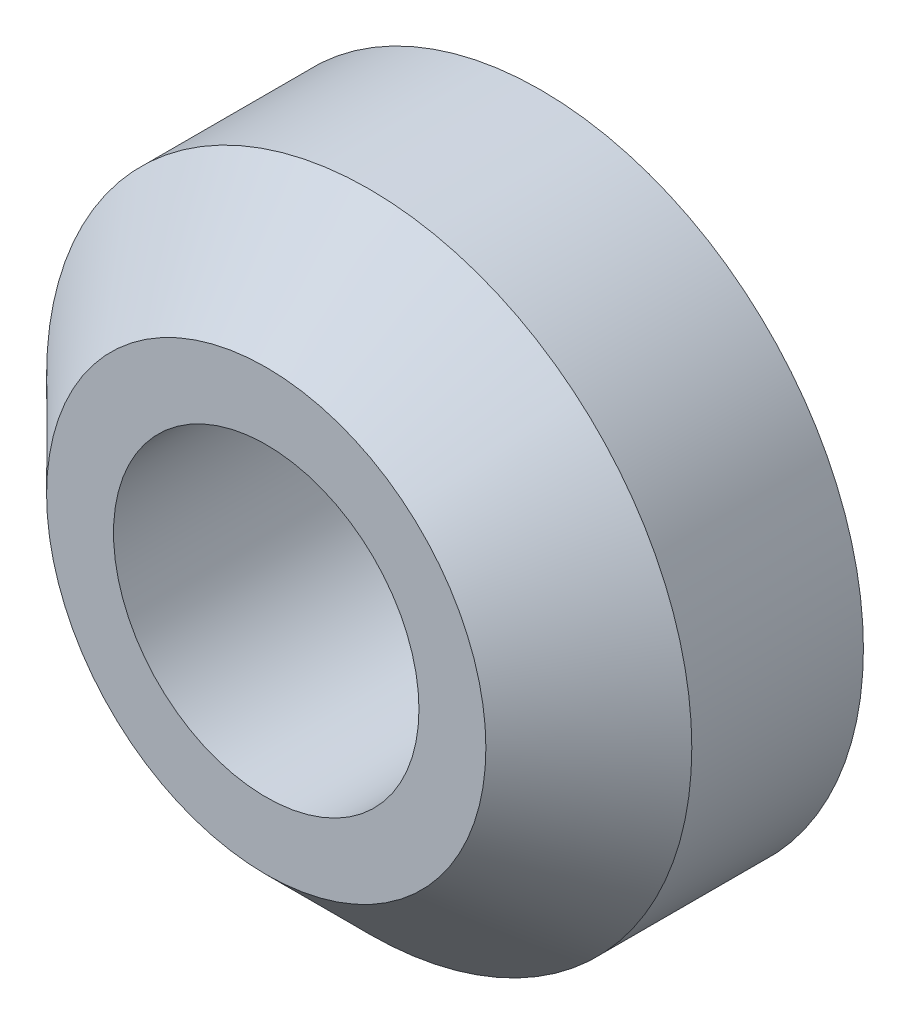
ISO-10303-21;
HEADER;
FILE_DESCRIPTION(('STEP AP214'),'2;1');
FILE_NAME('part.step','',(''),(''),'','','');
FILE_SCHEMA(('AUTOMOTIVE_DESIGN { 1 0 10303 214 1 1 1 1 }'));
ENDSEC;
DATA;
#1=APPLICATION_CONTEXT('core data for automotive mechanical design processes');
#2=APPLICATION_PROTOCOL_DEFINITION('international standard','automotive_design',2000,#1);
#3=PRODUCT_CONTEXT('',#1,'mechanical');
#4=PRODUCT('Part','Part','',(#3));
#5=PRODUCT_RELATED_PRODUCT_CATEGORY('part','',(#4));
#6=PRODUCT_DEFINITION_FORMATION('','',#4);
#7=PRODUCT_DEFINITION_CONTEXT('part definition',#1,'design');
#8=PRODUCT_DEFINITION('design','',#6,#7);
#9=PRODUCT_DEFINITION_SHAPE('','',#8);
#10=(LENGTH_UNIT() NAMED_UNIT(*) SI_UNIT(.MILLI.,.METRE.));
#11=(NAMED_UNIT(*) PLANE_ANGLE_UNIT() SI_UNIT($,.RADIAN.));
#12=(NAMED_UNIT(*) SI_UNIT($,.STERADIAN.) SOLID_ANGLE_UNIT());
#13=UNCERTAINTY_MEASURE_WITH_UNIT(LENGTH_MEASURE(1.E-05),#10,'distance_accuracy_value','');
#14=(GEOMETRIC_REPRESENTATION_CONTEXT(3) GLOBAL_UNCERTAINTY_ASSIGNED_CONTEXT((#13)) GLOBAL_UNIT_ASSIGNED_CONTEXT((#10,
#11,#12)) REPRESENTATION_CONTEXT('',''));
#15=CARTESIAN_POINT('',(0.,0.,0.));
#16=DIRECTION('',(0.,0.,1.));
#17=DIRECTION('',(1.,0.,0.));
#18=AXIS2_PLACEMENT_3D('',#15,#16,#17);
#19=CARTESIAN_POINT('',(0.,0.,2.032));
#20=DIRECTION('',(0.,0.,1.));
#21=DIRECTION('',(1.,0.,0.));
#22=AXIS2_PLACEMENT_3D('',#19,#20,#21);
#23=PLANE('',#22);
#24=CARTESIAN_POINT('',(0.,0.,2.032));
#25=DIRECTION('',(0.,0.,1.));
#26=DIRECTION('',(1.,0.,0.));
#27=AXIS2_PLACEMENT_3D('',#24,#25,#26);
#28=CIRCLE('',#27,1.6256);
#29=CARTESIAN_POINT('',(1.6256,0.,2.032));
#30=VERTEX_POINT('',#29);
#31=EDGE_CURVE('E42',#30,#30,#28,.T.);
#32=ORIENTED_EDGE('',*,*,#31,.T.);
#33=EDGE_LOOP('',(#32));
#34=FACE_BOUND('',#33,.T.);
#35=CARTESIAN_POINT('',(0.,0.,2.032));
#36=DIRECTION('',(0.,0.,1.));
#37=DIRECTION('',(1.,0.,0.));
#38=AXIS2_PLACEMENT_3D('',#35,#36,#37);
#39=CIRCLE('',#38,1.1303);
#40=CARTESIAN_POINT('',(1.1303,0.,2.032));
#41=VERTEX_POINT('',#40);
#42=EDGE_CURVE('E53',#41,#41,#39,.T.);
#43=ORIENTED_EDGE('',*,*,#42,.F.);
#44=EDGE_LOOP('',(#43));
#45=FACE_BOUND('',#44,.T.);
#46=ADVANCED_FACE('F34',(#34,#45),#23,.T.);
#47=CARTESIAN_POINT('',(0.,0.,0.));
#48=DIRECTION('',(0.,0.,1.));
#49=DIRECTION('',(1.,0.,0.));
#50=AXIS2_PLACEMENT_3D('',#47,#48,#49);
#51=PLANE('',#50);
#52=CARTESIAN_POINT('',(0.,0.,0.));
#53=DIRECTION('',(0.,0.,1.));
#54=DIRECTION('',(1.,0.,0.));
#55=AXIS2_PLACEMENT_3D('',#52,#53,#54);
#56=CIRCLE('',#55,2.3876);
#57=CARTESIAN_POINT('',(2.3876,0.,0.));
#58=VERTEX_POINT('',#57);
#59=EDGE_CURVE('E47',#58,#58,#56,.T.);
#60=ORIENTED_EDGE('',*,*,#59,.F.);
#61=EDGE_LOOP('',(#60));
#62=FACE_BOUND('',#61,.T.);
#63=CARTESIAN_POINT('',(0.,0.,0.));
#64=DIRECTION('',(0.,0.,1.));
#65=DIRECTION('',(1.,0.,0.));
#66=AXIS2_PLACEMENT_3D('',#63,#64,#65);
#67=CIRCLE('',#66,1.1303);
#68=CARTESIAN_POINT('',(1.1303,0.,0.));
#69=VERTEX_POINT('',#68);
#70=EDGE_CURVE('E56',#69,#69,#67,.T.);
#71=ORIENTED_EDGE('',*,*,#70,.T.);
#72=EDGE_LOOP('',(#71));
#73=FACE_BOUND('',#72,.T.);
#74=ADVANCED_FACE('F67',(#62,#73),#51,.F.);
#75=CARTESIAN_POINT('',(0.,0.,2.032));
#76=DIRECTION('',(0.,0.,-1.));
#77=DIRECTION('',(-1.,0.,0.));
#78=AXIS2_PLACEMENT_3D('',#75,#76,#77);
#79=CYLINDRICAL_SURFACE('',#78,2.3876);
#80=CARTESIAN_POINT('',(0.,0.,1.27));
#81=DIRECTION('',(0.,0.,1.));
#82=DIRECTION('',(1.,0.,0.));
#83=AXIS2_PLACEMENT_3D('',#80,#81,#82);
#84=CIRCLE('',#83,2.3876);
#85=CARTESIAN_POINT('',(2.3876,0.,1.27));
#86=VERTEX_POINT('',#85);
#87=EDGE_CURVE('E10',#86,#86,#84,.F.);
#88=ORIENTED_EDGE('',*,*,#87,.T.);
#89=EDGE_LOOP('',(#88));
#90=FACE_BOUND('',#89,.T.);
#91=ORIENTED_EDGE('',*,*,#59,.T.);
#92=EDGE_LOOP('',(#91));
#93=FACE_BOUND('',#92,.T.);
#94=ADVANCED_FACE('F72',(#90,#93),#79,.T.);
#95=CARTESIAN_POINT('',(0.,0.,2.032));
#96=DIRECTION('',(0.,0.,-1.));
#97=DIRECTION('',(-1.,0.,0.));
#98=AXIS2_PLACEMENT_3D('',#95,#96,#97);
#99=CYLINDRICAL_SURFACE('',#98,1.1303);
#100=ORIENTED_EDGE('',*,*,#42,.T.);
#101=EDGE_LOOP('',(#100));
#102=FACE_BOUND('',#101,.T.);
#103=ORIENTED_EDGE('',*,*,#70,.F.);
#104=EDGE_LOOP('',(#103));
#105=FACE_BOUND('',#104,.T.);
#106=ADVANCED_FACE('F63',(#102,#105),#99,.F.);
#107=CARTESIAN_POINT('',(0.,0.,2.032));
#108=DIRECTION('',(0.,0.,-1.));
#109=DIRECTION('',(-1.,0.,0.));
#110=AXIS2_PLACEMENT_3D('',#107,#108,#109);
#111=CONICAL_SURFACE('',#110,1.6256,0.785398163397447);
#112=ORIENTED_EDGE('',*,*,#87,.F.);
#113=EDGE_LOOP('',(#112));
#114=FACE_BOUND('',#113,.T.);
#115=ORIENTED_EDGE('',*,*,#31,.F.);
#116=EDGE_LOOP('',(#115));
#117=FACE_BOUND('',#116,.T.);
#118=ADVANCED_FACE('F36',(#114,#117),#111,.T.);
#119=CLOSED_SHELL('',(#46,#74,#94,#106,#118));
#120=MANIFOLD_SOLID_BREP('B2',#119);
#121=ADVANCED_BREP_SHAPE_REPRESENTATION('',(#18,#120),#14);
#122=SHAPE_DEFINITION_REPRESENTATION(#9,#121);
ENDSEC;
END-ISO-10303-21;
